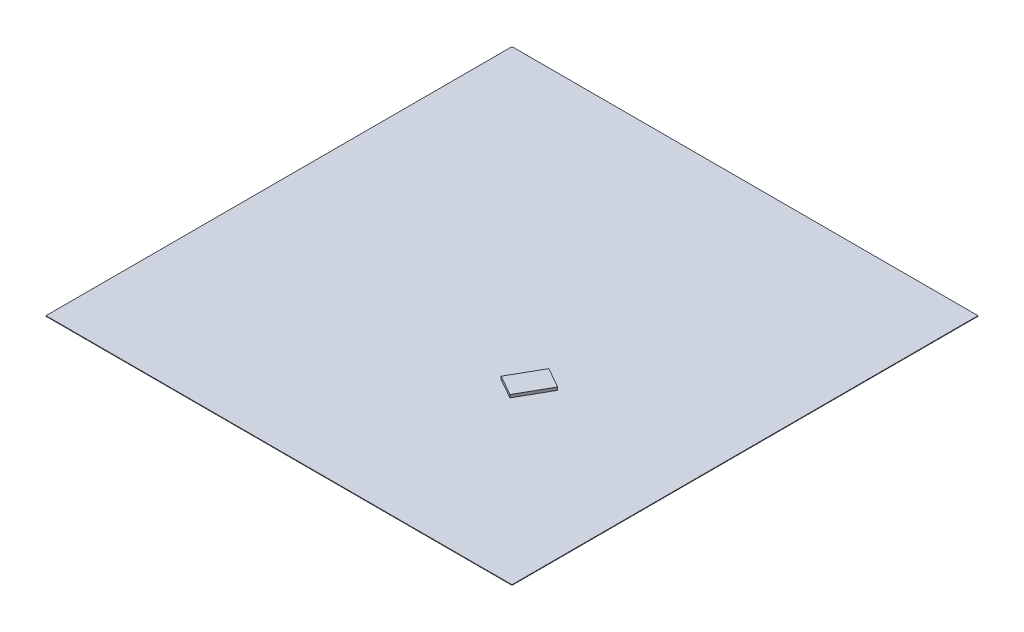
ISO-10303-21;
HEADER;
FILE_DESCRIPTION(('STEP AP214'),'2;1');
FILE_NAME('part.step','',(''),(''),'','','');
FILE_SCHEMA(('AUTOMOTIVE_DESIGN { 1 0 10303 214 1 1 1 1 }'));
ENDSEC;
DATA;
#1=APPLICATION_CONTEXT('core data for automotive mechanical design processes');
#2=APPLICATION_PROTOCOL_DEFINITION('international standard','automotive_design',2000,#1);
#3=PRODUCT_CONTEXT('',#1,'mechanical');
#4=PRODUCT('Part','Part','',(#3));
#5=PRODUCT_RELATED_PRODUCT_CATEGORY('part','',(#4));
#6=PRODUCT_DEFINITION_FORMATION('','',#4);
#7=PRODUCT_DEFINITION_CONTEXT('part definition',#1,'design');
#8=PRODUCT_DEFINITION('design','',#6,#7);
#9=PRODUCT_DEFINITION_SHAPE('','',#8);
#10=(LENGTH_UNIT() NAMED_UNIT(*) SI_UNIT(.MILLI.,.METRE.));
#11=(NAMED_UNIT(*) PLANE_ANGLE_UNIT() SI_UNIT($,.RADIAN.));
#12=(NAMED_UNIT(*) SI_UNIT($,.STERADIAN.) SOLID_ANGLE_UNIT());
#13=UNCERTAINTY_MEASURE_WITH_UNIT(LENGTH_MEASURE(1.E-05),#10,'distance_accuracy_value','');
#14=(GEOMETRIC_REPRESENTATION_CONTEXT(3) GLOBAL_UNCERTAINTY_ASSIGNED_CONTEXT((#13)) GLOBAL_UNIT_ASSIGNED_CONTEXT((#10,
#11,#12)) REPRESENTATION_CONTEXT('',''));
#15=CARTESIAN_POINT('',(0.,0.,0.));
#16=DIRECTION('',(0.,0.,1.));
#17=DIRECTION('',(1.,0.,0.));
#18=AXIS2_PLACEMENT_3D('',#15,#16,#17);
#19=CARTESIAN_POINT('',(0.,50.,0.));
#20=DIRECTION('',(0.,1.,0.));
#21=DIRECTION('',(0.,0.,1.));
#22=AXIS2_PLACEMENT_3D('',#19,#20,#21);
#23=PLANE('',#22);
#24=DIRECTION('',(0.,0.,1.));
#25=VECTOR('',#24,1.);
#26=CARTESIAN_POINT('',(-43023.6220472441,50.,-47496.062992126));
#27=LINE('',#26,#25);
#28=CARTESIAN_POINT('',(-43023.6220472441,50.,-47496.062992126));
#29=VERTEX_POINT('',#28);
#30=CARTESIAN_POINT('',(-43023.6220472441,50.,32503.937007874));
#31=VERTEX_POINT('',#30);
#32=EDGE_CURVE('E150',#29,#31,#27,.T.);
#33=ORIENTED_EDGE('',*,*,#32,.T.);
#34=DIRECTION('',(1.,0.,0.));
#35=VECTOR('',#34,1.);
#36=CARTESIAN_POINT('',(-43023.6220472441,50.,32503.937007874));
#37=LINE('',#36,#35);
#38=CARTESIAN_POINT('',(36976.3779527559,50.,32503.937007874));
#39=VERTEX_POINT('',#38);
#40=EDGE_CURVE('E95',#31,#39,#37,.T.);
#41=ORIENTED_EDGE('',*,*,#40,.T.);
#42=DIRECTION('',(0.,0.,-1.));
#43=VECTOR('',#42,1.);
#44=CARTESIAN_POINT('',(36976.3779527559,50.,-47496.062992126));
#45=LINE('',#44,#43);
#46=CARTESIAN_POINT('',(36976.3779527559,50.,-47496.062992126));
#47=VERTEX_POINT('',#46);
#48=EDGE_CURVE('E153',#39,#47,#45,.T.);
#49=ORIENTED_EDGE('',*,*,#48,.T.);
#50=DIRECTION('',(-1.,0.,0.));
#51=VECTOR('',#50,1.);
#52=CARTESIAN_POINT('',(-43023.6220472441,50.,-47496.062992126));
#53=LINE('',#52,#51);
#54=EDGE_CURVE('E67',#47,#29,#53,.T.);
#55=ORIENTED_EDGE('',*,*,#54,.T.);
#56=EDGE_LOOP('',(#33,#41,#49,#55));
#57=FACE_BOUND('',#56,.T.);
#58=DIRECTION('',(0.870022185848612,0.,0.493012571980881));
#59=VECTOR('',#58,1.);
#60=CARTESIAN_POINT('',(5550.1659451965,50.,2934.33626444847));
#61=LINE('',#60,#59);
#62=CARTESIAN_POINT('',(5550.1659451965,50.,2934.33626444847));
#63=VERTEX_POINT('',#62);
#64=CARTESIAN_POINT('',(9030.25468859095,50.,4906.386552372));
#65=VERTEX_POINT('',#64);
#66=EDGE_CURVE('E297',#63,#65,#61,.T.);
#67=ORIENTED_EDGE('',*,*,#66,.F.);
#68=DIRECTION('',(-0.493012571980881,0.,0.870022185848612));
#69=VECTOR('',#68,1.);
#70=CARTESIAN_POINT('',(5550.1659451965,50.,2934.33626444847));
#71=LINE('',#70,#69);
#72=CARTESIAN_POINT('',(8508.24137708179,50.,-2285.7968506432));
#73=VERTEX_POINT('',#72);
#74=EDGE_CURVE('E140',#73,#63,#71,.T.);
#75=ORIENTED_EDGE('',*,*,#74,.F.);
#76=DIRECTION('',(-0.870022185848612,0.,-0.493012571980881));
#77=VECTOR('',#76,1.);
#78=CARTESIAN_POINT('',(8508.24137708179,50.,-2285.7968506432));
#79=LINE('',#78,#77);
#80=CARTESIAN_POINT('',(11988.3301204762,50.,-313.746562719675));
#81=VERTEX_POINT('',#80);
#82=EDGE_CURVE('E136',#81,#73,#79,.T.);
#83=ORIENTED_EDGE('',*,*,#82,.F.);
#84=DIRECTION('',(0.493012571980881,0.,-0.870022185848612));
#85=VECTOR('',#84,1.);
#86=CARTESIAN_POINT('',(9030.25468859095,50.,4906.386552372));
#87=LINE('',#86,#85);
#88=EDGE_CURVE('E294',#65,#81,#87,.T.);
#89=ORIENTED_EDGE('',*,*,#88,.F.);
#90=EDGE_LOOP('',(#67,#75,#83,#89));
#91=FACE_BOUND('',#90,.T.);
#92=ADVANCED_FACE('F43',(#57,#91),#23,.T.);
#93=CARTESIAN_POINT('',(-43023.6220472441,50.,-47496.062992126));
#94=DIRECTION('',(1.,0.,0.));
#95=DIRECTION('',(0.,0.,-1.));
#96=AXIS2_PLACEMENT_3D('',#93,#94,#95);
#97=PLANE('',#96);
#98=DIRECTION('',(0.,0.,1.));
#99=VECTOR('',#98,1.);
#100=CARTESIAN_POINT('',(-43023.6220472441,-50.,-47496.062992126));
#101=LINE('',#100,#99);
#102=CARTESIAN_POINT('',(-43023.6220472441,-50.,-47496.062992126));
#103=VERTEX_POINT('',#102);
#104=CARTESIAN_POINT('',(-43023.6220472441,-50.,32503.937007874));
#105=VERTEX_POINT('',#104);
#106=EDGE_CURVE('E142',#103,#105,#101,.T.);
#107=ORIENTED_EDGE('',*,*,#106,.T.);
#108=DIRECTION('',(0.,-1.,0.));
#109=VECTOR('',#108,1.);
#110=CARTESIAN_POINT('',(-43023.6220472441,50.,32503.937007874));
#111=LINE('',#110,#109);
#112=EDGE_CURVE('E11',#31,#105,#111,.T.);
#113=ORIENTED_EDGE('',*,*,#112,.F.);
#114=ORIENTED_EDGE('',*,*,#32,.F.);
#115=DIRECTION('',(0.,-1.,0.));
#116=VECTOR('',#115,1.);
#117=CARTESIAN_POINT('',(-43023.6220472441,50.,-47496.062992126));
#118=LINE('',#117,#116);
#119=EDGE_CURVE('E155',#29,#103,#118,.T.);
#120=ORIENTED_EDGE('',*,*,#119,.T.);
#121=EDGE_LOOP('',(#107,#113,#114,#120));
#122=FACE_BOUND('',#121,.T.);
#123=ADVANCED_FACE('F45',(#122),#97,.F.);
#124=CARTESIAN_POINT('',(-43023.6220472441,50.,32503.937007874));
#125=DIRECTION('',(0.,0.,-1.));
#126=DIRECTION('',(-1.,0.,0.));
#127=AXIS2_PLACEMENT_3D('',#124,#125,#126);
#128=PLANE('',#127);
#129=DIRECTION('',(1.,0.,0.));
#130=VECTOR('',#129,1.);
#131=CARTESIAN_POINT('',(-43023.6220472441,-50.,32503.937007874));
#132=LINE('',#131,#130);
#133=CARTESIAN_POINT('',(36976.3779527559,-50.,32503.937007874));
#134=VERTEX_POINT('',#133);
#135=EDGE_CURVE('E145',#105,#134,#132,.T.);
#136=ORIENTED_EDGE('',*,*,#135,.T.);
#137=DIRECTION('',(0.,-1.,0.));
#138=VECTOR('',#137,1.);
#139=CARTESIAN_POINT('',(36976.3779527559,50.,32503.937007874));
#140=LINE('',#139,#138);
#141=EDGE_CURVE('E51',#39,#134,#140,.T.);
#142=ORIENTED_EDGE('',*,*,#141,.F.);
#143=ORIENTED_EDGE('',*,*,#40,.F.);
#144=ORIENTED_EDGE('',*,*,#112,.T.);
#145=EDGE_LOOP('',(#136,#142,#143,#144));
#146=FACE_BOUND('',#145,.T.);
#147=ADVANCED_FACE('F183',(#146),#128,.F.);
#148=CARTESIAN_POINT('',(36976.3779527559,50.,-47496.062992126));
#149=DIRECTION('',(-1.,0.,0.));
#150=DIRECTION('',(0.,0.,1.));
#151=AXIS2_PLACEMENT_3D('',#148,#149,#150);
#152=PLANE('',#151);
#153=DIRECTION('',(0.,0.,-1.));
#154=VECTOR('',#153,1.);
#155=CARTESIAN_POINT('',(36976.3779527559,-50.,-47496.062992126));
#156=LINE('',#155,#154);
#157=CARTESIAN_POINT('',(36976.3779527559,-50.,-47496.062992126));
#158=VERTEX_POINT('',#157);
#159=EDGE_CURVE('E158',#134,#158,#156,.T.);
#160=ORIENTED_EDGE('',*,*,#159,.T.);
#161=DIRECTION('',(0.,-1.,0.));
#162=VECTOR('',#161,1.);
#163=CARTESIAN_POINT('',(36976.3779527559,50.,-47496.062992126));
#164=LINE('',#163,#162);
#165=EDGE_CURVE('E162',#47,#158,#164,.T.);
#166=ORIENTED_EDGE('',*,*,#165,.F.);
#167=ORIENTED_EDGE('',*,*,#48,.F.);
#168=ORIENTED_EDGE('',*,*,#141,.T.);
#169=EDGE_LOOP('',(#160,#166,#167,#168));
#170=FACE_BOUND('',#169,.T.);
#171=ADVANCED_FACE('F167',(#170),#152,.F.);
#172=CARTESIAN_POINT('',(-43023.6220472441,50.,-47496.062992126));
#173=DIRECTION('',(0.,0.,1.));
#174=DIRECTION('',(1.,0.,0.));
#175=AXIS2_PLACEMENT_3D('',#172,#173,#174);
#176=PLANE('',#175);
#177=DIRECTION('',(-1.,0.,0.));
#178=VECTOR('',#177,1.);
#179=CARTESIAN_POINT('',(-43023.6220472441,-50.,-47496.062992126));
#180=LINE('',#179,#178);
#181=EDGE_CURVE('E88',#158,#103,#180,.T.);
#182=ORIENTED_EDGE('',*,*,#181,.T.);
#183=ORIENTED_EDGE('',*,*,#119,.F.);
#184=ORIENTED_EDGE('',*,*,#54,.F.);
#185=ORIENTED_EDGE('',*,*,#165,.T.);
#186=EDGE_LOOP('',(#182,#183,#184,#185));
#187=FACE_BOUND('',#186,.T.);
#188=ADVANCED_FACE('F175',(#187),#176,.F.);
#189=CARTESIAN_POINT('',(0.,-50.,0.));
#190=DIRECTION('',(0.,1.,0.));
#191=DIRECTION('',(0.,0.,1.));
#192=AXIS2_PLACEMENT_3D('',#189,#190,#191);
#193=PLANE('',#192);
#194=ORIENTED_EDGE('',*,*,#106,.F.);
#195=ORIENTED_EDGE('',*,*,#181,.F.);
#196=ORIENTED_EDGE('',*,*,#159,.F.);
#197=ORIENTED_EDGE('',*,*,#135,.F.);
#198=EDGE_LOOP('',(#194,#195,#196,#197));
#199=FACE_BOUND('',#198,.T.);
#200=ADVANCED_FACE('F171',(#199),#193,.F.);
#201=CARTESIAN_POINT('',(5550.1659451965,550.,2934.33626444847));
#202=DIRECTION('',(0.870022185848612,0.,0.493012571980881));
#203=DIRECTION('',(0.493012571980881,0.,-0.870022185848612));
#204=AXIS2_PLACEMENT_3D('',#201,#202,#203);
#205=PLANE('',#204);
#206=ORIENTED_EDGE('',*,*,#74,.T.);
#207=DIRECTION('',(0.,-1.,0.));
#208=VECTOR('',#207,1.);
#209=CARTESIAN_POINT('',(5550.1659451965,550.,2934.33626444847));
#210=LINE('',#209,#208);
#211=CARTESIAN_POINT('',(5550.1659451965,550.,2934.33626444847));
#212=VERTEX_POINT('',#211);
#213=EDGE_CURVE('E121',#212,#63,#210,.T.);
#214=ORIENTED_EDGE('',*,*,#213,.F.);
#215=DIRECTION('',(-0.493012571980881,0.,0.870022185848612));
#216=VECTOR('',#215,1.);
#217=CARTESIAN_POINT('',(5550.1659451965,550.,2934.33626444847));
#218=LINE('',#217,#216);
#219=CARTESIAN_POINT('',(8508.24137708179,550.,-2285.7968506432));
#220=VERTEX_POINT('',#219);
#221=EDGE_CURVE('E128',#220,#212,#218,.T.);
#222=ORIENTED_EDGE('',*,*,#221,.F.);
#223=DIRECTION('',(0.,-1.,0.));
#224=VECTOR('',#223,1.);
#225=CARTESIAN_POINT('',(8508.24137708179,550.,-2285.7968506432));
#226=LINE('',#225,#224);
#227=EDGE_CURVE('E292',#220,#73,#226,.T.);
#228=ORIENTED_EDGE('',*,*,#227,.T.);
#229=EDGE_LOOP('',(#206,#214,#222,#228));
#230=FACE_BOUND('',#229,.T.);
#231=ADVANCED_FACE('F138',(#230),#205,.F.);
#232=CARTESIAN_POINT('',(5550.1659451965,550.,2934.33626444847));
#233=DIRECTION('',(0.493012571980881,0.,-0.870022185848612));
#234=DIRECTION('',(-0.870022185848612,0.,-0.493012571980881));
#235=AXIS2_PLACEMENT_3D('',#232,#233,#234);
#236=PLANE('',#235);
#237=ORIENTED_EDGE('',*,*,#66,.T.);
#238=DIRECTION('',(0.,-1.,0.));
#239=VECTOR('',#238,1.);
#240=CARTESIAN_POINT('',(9030.25468859095,550.,4906.386552372));
#241=LINE('',#240,#239);
#242=CARTESIAN_POINT('',(9030.25468859095,550.,4906.386552372));
#243=VERTEX_POINT('',#242);
#244=EDGE_CURVE('E124',#243,#65,#241,.T.);
#245=ORIENTED_EDGE('',*,*,#244,.F.);
#246=DIRECTION('',(0.870022185848612,0.,0.493012571980881));
#247=VECTOR('',#246,1.);
#248=CARTESIAN_POINT('',(5550.1659451965,550.,2934.33626444847));
#249=LINE('',#248,#247);
#250=EDGE_CURVE('E117',#212,#243,#249,.T.);
#251=ORIENTED_EDGE('',*,*,#250,.F.);
#252=ORIENTED_EDGE('',*,*,#213,.T.);
#253=EDGE_LOOP('',(#237,#245,#251,#252));
#254=FACE_BOUND('',#253,.T.);
#255=ADVANCED_FACE('F119',(#254),#236,.F.);
#256=CARTESIAN_POINT('',(9030.25468859095,550.,4906.386552372));
#257=DIRECTION('',(-0.870022185848612,0.,-0.493012571980881));
#258=DIRECTION('',(-0.493012571980881,0.,0.870022185848612));
#259=AXIS2_PLACEMENT_3D('',#256,#257,#258);
#260=PLANE('',#259);
#261=ORIENTED_EDGE('',*,*,#88,.T.);
#262=DIRECTION('',(0.,-1.,0.));
#263=VECTOR('',#262,1.);
#264=CARTESIAN_POINT('',(11988.3301204762,550.,-313.746562719675));
#265=LINE('',#264,#263);
#266=CARTESIAN_POINT('',(11988.3301204762,550.,-313.746562719675));
#267=VERTEX_POINT('',#266);
#268=EDGE_CURVE('E58',#267,#81,#265,.T.);
#269=ORIENTED_EDGE('',*,*,#268,.F.);
#270=DIRECTION('',(0.493012571980881,0.,-0.870022185848612));
#271=VECTOR('',#270,1.);
#272=CARTESIAN_POINT('',(9030.25468859095,550.,4906.386552372));
#273=LINE('',#272,#271);
#274=EDGE_CURVE('E127',#243,#267,#273,.T.);
#275=ORIENTED_EDGE('',*,*,#274,.F.);
#276=ORIENTED_EDGE('',*,*,#244,.T.);
#277=EDGE_LOOP('',(#261,#269,#275,#276));
#278=FACE_BOUND('',#277,.T.);
#279=ADVANCED_FACE('F196',(#278),#260,.F.);
#280=CARTESIAN_POINT('',(8508.24137708179,550.,-2285.7968506432));
#281=DIRECTION('',(-0.493012571980881,0.,0.870022185848612));
#282=DIRECTION('',(0.870022185848612,0.,0.493012571980881));
#283=AXIS2_PLACEMENT_3D('',#280,#281,#282);
#284=PLANE('',#283);
#285=ORIENTED_EDGE('',*,*,#82,.T.);
#286=ORIENTED_EDGE('',*,*,#227,.F.);
#287=DIRECTION('',(-0.870022185848612,0.,-0.493012571980881));
#288=VECTOR('',#287,1.);
#289=CARTESIAN_POINT('',(8508.24137708179,550.,-2285.7968506432));
#290=LINE('',#289,#288);
#291=EDGE_CURVE('E132',#267,#220,#290,.T.);
#292=ORIENTED_EDGE('',*,*,#291,.F.);
#293=ORIENTED_EDGE('',*,*,#268,.T.);
#294=EDGE_LOOP('',(#285,#286,#292,#293));
#295=FACE_BOUND('',#294,.T.);
#296=ADVANCED_FACE('F199',(#295),#284,.F.);
#297=CARTESIAN_POINT('',(0.,550.,0.));
#298=DIRECTION('',(0.,-1.,0.));
#299=DIRECTION('',(0.,0.,-1.));
#300=AXIS2_PLACEMENT_3D('',#297,#298,#299);
#301=PLANE('',#300);
#302=ORIENTED_EDGE('',*,*,#221,.T.);
#303=ORIENTED_EDGE('',*,*,#250,.T.);
#304=ORIENTED_EDGE('',*,*,#274,.T.);
#305=ORIENTED_EDGE('',*,*,#291,.T.);
#306=EDGE_LOOP('',(#302,#303,#304,#305));
#307=FACE_BOUND('',#306,.T.);
#308=ADVANCED_FACE('F131',(#307),#301,.F.);
#309=CLOSED_SHELL('',(#92,#123,#147,#171,#188,#200,#231,#255,#279,#296,#308));
#310=MANIFOLD_SOLID_BREP('B2',#309);
#311=ADVANCED_BREP_SHAPE_REPRESENTATION('',(#18,#310),#14);
#312=SHAPE_DEFINITION_REPRESENTATION(#9,#311);
ENDSEC;
END-ISO-10303-21;
